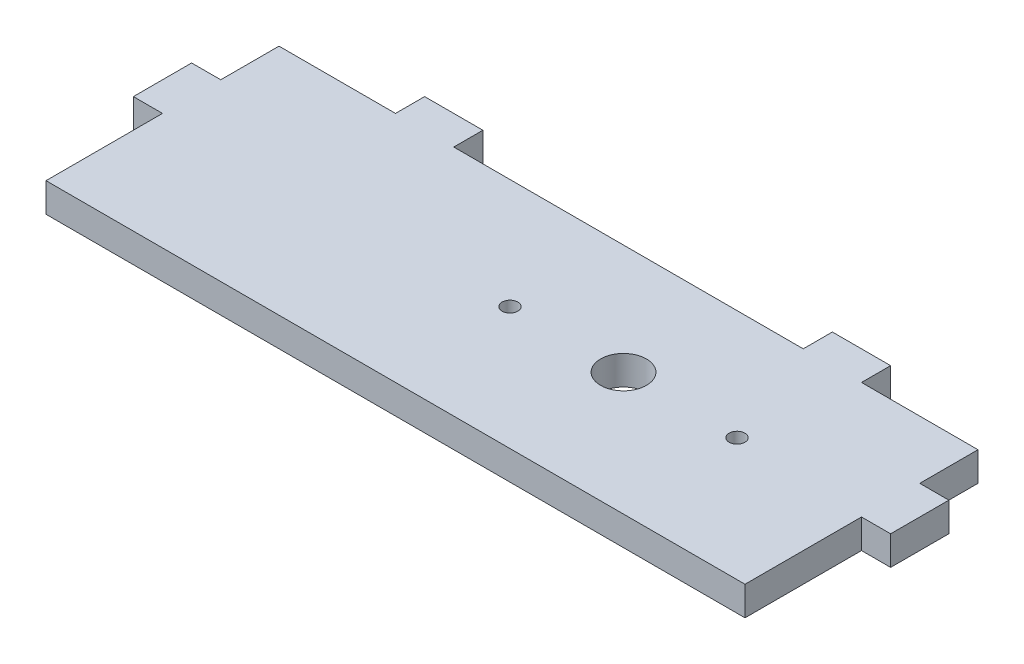
ISO-10303-21;
HEADER;
FILE_DESCRIPTION(('STEP AP214'),'2;1');
FILE_NAME('part.step','',(''),(''),'','','');
FILE_SCHEMA(('AUTOMOTIVE_DESIGN { 1 0 10303 214 1 1 1 1 }'));
ENDSEC;
DATA;
#1=APPLICATION_CONTEXT('core data for automotive mechanical design processes');
#2=APPLICATION_PROTOCOL_DEFINITION('international standard','automotive_design',2000,#1);
#3=PRODUCT_CONTEXT('',#1,'mechanical');
#4=PRODUCT('Part','Part','',(#3));
#5=PRODUCT_RELATED_PRODUCT_CATEGORY('part','',(#4));
#6=PRODUCT_DEFINITION_FORMATION('','',#4);
#7=PRODUCT_DEFINITION_CONTEXT('part definition',#1,'design');
#8=PRODUCT_DEFINITION('design','',#6,#7);
#9=PRODUCT_DEFINITION_SHAPE('','',#8);
#10=(LENGTH_UNIT() NAMED_UNIT(*) SI_UNIT(.MILLI.,.METRE.));
#11=(NAMED_UNIT(*) PLANE_ANGLE_UNIT() SI_UNIT($,.RADIAN.));
#12=(NAMED_UNIT(*) SI_UNIT($,.STERADIAN.) SOLID_ANGLE_UNIT());
#13=UNCERTAINTY_MEASURE_WITH_UNIT(LENGTH_MEASURE(1.E-05),#10,'distance_accuracy_value','');
#14=(GEOMETRIC_REPRESENTATION_CONTEXT(3) GLOBAL_UNCERTAINTY_ASSIGNED_CONTEXT((#13)) GLOBAL_UNIT_ASSIGNED_CONTEXT((#10,
#11,#12)) REPRESENTATION_CONTEXT('',''));
#15=CARTESIAN_POINT('',(0.,0.,0.));
#16=DIRECTION('',(0.,0.,1.));
#17=DIRECTION('',(1.,0.,0.));
#18=AXIS2_PLACEMENT_3D('',#15,#16,#17);
#19=CARTESIAN_POINT('',(0.,6.35,0.));
#20=DIRECTION('',(0.,0.,-1.));
#21=DIRECTION('',(-1.,0.,0.));
#22=AXIS2_PLACEMENT_3D('',#19,#20,#21);
#23=PLANE('',#22);
#24=DIRECTION('',(1.,0.,0.));
#25=VECTOR('',#24,1.);
#26=CARTESIAN_POINT('',(0.,0.,0.));
#27=LINE('',#26,#25);
#28=CARTESIAN_POINT('',(0.,0.,0.));
#29=VERTEX_POINT('',#28);
#30=CARTESIAN_POINT('',(152.4,0.,0.));
#31=VERTEX_POINT('',#30);
#32=EDGE_CURVE('E215',#29,#31,#27,.T.);
#33=ORIENTED_EDGE('',*,*,#32,.T.);
#34=DIRECTION('',(0.,-1.,0.));
#35=VECTOR('',#34,1.);
#36=CARTESIAN_POINT('',(152.4,6.35,0.));
#37=LINE('',#36,#35);
#38=CARTESIAN_POINT('',(152.4,6.35,0.));
#39=VERTEX_POINT('',#38);
#40=EDGE_CURVE('E11',#39,#31,#37,.T.);
#41=ORIENTED_EDGE('',*,*,#40,.F.);
#42=DIRECTION('',(1.,0.,0.));
#43=VECTOR('',#42,1.);
#44=CARTESIAN_POINT('',(0.,6.35,0.));
#45=LINE('',#44,#43);
#46=CARTESIAN_POINT('',(0.,6.35,0.));
#47=VERTEX_POINT('',#46);
#48=EDGE_CURVE('E654',#47,#39,#45,.T.);
#49=ORIENTED_EDGE('',*,*,#48,.F.);
#50=DIRECTION('',(0.,-1.,0.));
#51=VECTOR('',#50,1.);
#52=CARTESIAN_POINT('',(0.,6.35,0.));
#53=LINE('',#52,#51);
#54=EDGE_CURVE('E51',#47,#29,#53,.T.);
#55=ORIENTED_EDGE('',*,*,#54,.T.);
#56=EDGE_LOOP('',(#33,#41,#49,#55));
#57=FACE_BOUND('',#56,.T.);
#58=ADVANCED_FACE('F34',(#57),#23,.F.);
#59=CARTESIAN_POINT('',(152.4,6.35,0.));
#60=DIRECTION('',(-1.,0.,0.));
#61=DIRECTION('',(0.,0.,1.));
#62=AXIS2_PLACEMENT_3D('',#59,#60,#61);
#63=PLANE('',#62);
#64=DIRECTION('',(0.,0.,-1.));
#65=VECTOR('',#64,1.);
#66=CARTESIAN_POINT('',(152.4,0.,0.));
#67=LINE('',#66,#65);
#68=CARTESIAN_POINT('',(152.4,0.,-25.4));
#69=VERTEX_POINT('',#68);
#70=EDGE_CURVE('E217',#31,#69,#67,.T.);
#71=ORIENTED_EDGE('',*,*,#70,.T.);
#72=DIRECTION('',(0.,-1.,0.));
#73=VECTOR('',#72,1.);
#74=CARTESIAN_POINT('',(152.4,6.35,-25.4));
#75=LINE('',#74,#73);
#76=CARTESIAN_POINT('',(152.4,6.35,-25.4));
#77=VERTEX_POINT('',#76);
#78=EDGE_CURVE('E43',#77,#69,#75,.T.);
#79=ORIENTED_EDGE('',*,*,#78,.F.);
#80=DIRECTION('',(0.,0.,-1.));
#81=VECTOR('',#80,1.);
#82=CARTESIAN_POINT('',(152.4,6.35,0.));
#83=LINE('',#82,#81);
#84=EDGE_CURVE('E125',#39,#77,#83,.T.);
#85=ORIENTED_EDGE('',*,*,#84,.F.);
#86=ORIENTED_EDGE('',*,*,#40,.T.);
#87=EDGE_LOOP('',(#71,#79,#85,#86));
#88=FACE_BOUND('',#87,.T.);
#89=ADVANCED_FACE('F383',(#88),#63,.F.);
#90=CARTESIAN_POINT('',(0.,6.35,-25.4));
#91=DIRECTION('',(0.,0.,-1.));
#92=DIRECTION('',(-1.,0.,0.));
#93=AXIS2_PLACEMENT_3D('',#90,#91,#92);
#94=PLANE('',#93);
#95=DIRECTION('',(1.,0.,0.));
#96=VECTOR('',#95,1.);
#97=CARTESIAN_POINT('',(0.,0.,-25.4));
#98=LINE('',#97,#96);
#99=CARTESIAN_POINT('',(158.75,0.,-25.4));
#100=VERTEX_POINT('',#99);
#101=EDGE_CURVE('E219',#69,#100,#98,.T.);
#102=ORIENTED_EDGE('',*,*,#101,.T.);
#103=DIRECTION('',(0.,-1.,0.));
#104=VECTOR('',#103,1.);
#105=CARTESIAN_POINT('',(158.75,6.35,-25.4));
#106=LINE('',#105,#104);
#107=CARTESIAN_POINT('',(158.75,6.35,-25.4));
#108=VERTEX_POINT('',#107);
#109=EDGE_CURVE('E290',#108,#100,#106,.T.);
#110=ORIENTED_EDGE('',*,*,#109,.F.);
#111=DIRECTION('',(1.,0.,0.));
#112=VECTOR('',#111,1.);
#113=CARTESIAN_POINT('',(0.,6.35,-25.4));
#114=LINE('',#113,#112);
#115=EDGE_CURVE('E297',#77,#108,#114,.T.);
#116=ORIENTED_EDGE('',*,*,#115,.F.);
#117=ORIENTED_EDGE('',*,*,#78,.T.);
#118=EDGE_LOOP('',(#102,#110,#116,#117));
#119=FACE_BOUND('',#118,.T.);
#120=ADVANCED_FACE('F295',(#119),#94,.F.);
#121=CARTESIAN_POINT('',(158.75,6.35,0.));
#122=DIRECTION('',(1.,0.,0.));
#123=DIRECTION('',(0.,0.,-1.));
#124=AXIS2_PLACEMENT_3D('',#121,#122,#123);
#125=PLANE('',#124);
#126=DIRECTION('',(0.,0.,1.));
#127=VECTOR('',#126,1.);
#128=CARTESIAN_POINT('',(158.75,0.,0.));
#129=LINE('',#128,#127);
#130=CARTESIAN_POINT('',(158.75,0.,-38.1));
#131=VERTEX_POINT('',#130);
#132=EDGE_CURVE('E223',#131,#100,#129,.T.);
#133=ORIENTED_EDGE('',*,*,#132,.F.);
#134=DIRECTION('',(0.,-1.,0.));
#135=VECTOR('',#134,1.);
#136=CARTESIAN_POINT('',(158.75,6.35,-38.1));
#137=LINE('',#136,#135);
#138=CARTESIAN_POINT('',(158.75,6.35,-38.1));
#139=VERTEX_POINT('',#138);
#140=EDGE_CURVE('E288',#139,#131,#137,.T.);
#141=ORIENTED_EDGE('',*,*,#140,.F.);
#142=DIRECTION('',(0.,0.,1.));
#143=VECTOR('',#142,1.);
#144=CARTESIAN_POINT('',(158.75,6.35,0.));
#145=LINE('',#144,#143);
#146=EDGE_CURVE('E307',#139,#108,#145,.T.);
#147=ORIENTED_EDGE('',*,*,#146,.T.);
#148=ORIENTED_EDGE('',*,*,#109,.T.);
#149=EDGE_LOOP('',(#133,#141,#147,#148));
#150=FACE_BOUND('',#149,.T.);
#151=ADVANCED_FACE('F304',(#150),#125,.T.);
#152=CARTESIAN_POINT('',(0.,6.35,-38.1));
#153=DIRECTION('',(0.,0.,-1.));
#154=DIRECTION('',(-1.,0.,0.));
#155=AXIS2_PLACEMENT_3D('',#152,#153,#154);
#156=PLANE('',#155);
#157=DIRECTION('',(1.,0.,0.));
#158=VECTOR('',#157,1.);
#159=CARTESIAN_POINT('',(0.,0.,-38.1));
#160=LINE('',#159,#158);
#161=CARTESIAN_POINT('',(152.4,0.,-38.1));
#162=VERTEX_POINT('',#161);
#163=EDGE_CURVE('E226',#162,#131,#160,.T.);
#164=ORIENTED_EDGE('',*,*,#163,.F.);
#165=DIRECTION('',(0.,-1.,0.));
#166=VECTOR('',#165,1.);
#167=CARTESIAN_POINT('',(152.4,6.35,-38.1));
#168=LINE('',#167,#166);
#169=CARTESIAN_POINT('',(152.4,6.35,-38.1));
#170=VERTEX_POINT('',#169);
#171=EDGE_CURVE('E286',#170,#162,#168,.T.);
#172=ORIENTED_EDGE('',*,*,#171,.F.);
#173=DIRECTION('',(1.,0.,0.));
#174=VECTOR('',#173,1.);
#175=CARTESIAN_POINT('',(0.,6.35,-38.1));
#176=LINE('',#175,#174);
#177=EDGE_CURVE('E310',#170,#139,#176,.T.);
#178=ORIENTED_EDGE('',*,*,#177,.T.);
#179=ORIENTED_EDGE('',*,*,#140,.T.);
#180=EDGE_LOOP('',(#164,#172,#178,#179));
#181=FACE_BOUND('',#180,.T.);
#182=ADVANCED_FACE('F601',(#181),#156,.T.);
#183=CARTESIAN_POINT('',(152.4,0.,-50.8));
#184=VERTEX_POINT('',#183);
#185=EDGE_CURVE('E220',#162,#184,#67,.T.);
#186=ORIENTED_EDGE('',*,*,#185,.T.);
#187=DIRECTION('',(0.,-1.,0.));
#188=VECTOR('',#187,1.);
#189=CARTESIAN_POINT('',(152.4,6.35,-50.8));
#190=LINE('',#189,#188);
#191=CARTESIAN_POINT('',(152.4,6.35,-50.8));
#192=VERTEX_POINT('',#191);
#193=EDGE_CURVE('E284',#192,#184,#190,.T.);
#194=ORIENTED_EDGE('',*,*,#193,.F.);
#195=EDGE_CURVE('E312',#170,#192,#83,.T.);
#196=ORIENTED_EDGE('',*,*,#195,.F.);
#197=ORIENTED_EDGE('',*,*,#171,.T.);
#198=EDGE_LOOP('',(#186,#194,#196,#197));
#199=FACE_BOUND('',#198,.T.);
#200=ADVANCED_FACE('F389',(#199),#63,.F.);
#201=CARTESIAN_POINT('',(0.,6.35,-50.8));
#202=DIRECTION('',(0.,0.,-1.));
#203=DIRECTION('',(-1.,0.,0.));
#204=AXIS2_PLACEMENT_3D('',#201,#202,#203);
#205=PLANE('',#204);
#206=DIRECTION('',(1.,0.,0.));
#207=VECTOR('',#206,1.);
#208=CARTESIAN_POINT('',(0.,0.,-50.8));
#209=LINE('',#208,#207);
#210=CARTESIAN_POINT('',(127.,0.,-50.8));
#211=VERTEX_POINT('',#210);
#212=EDGE_CURVE('E229',#211,#184,#209,.T.);
#213=ORIENTED_EDGE('',*,*,#212,.F.);
#214=DIRECTION('',(0.,-1.,0.));
#215=VECTOR('',#214,1.);
#216=CARTESIAN_POINT('',(127.,6.35,-50.8));
#217=LINE('',#216,#215);
#218=CARTESIAN_POINT('',(127.,6.35,-50.8));
#219=VERTEX_POINT('',#218);
#220=EDGE_CURVE('E282',#219,#211,#217,.T.);
#221=ORIENTED_EDGE('',*,*,#220,.F.);
#222=DIRECTION('',(1.,0.,0.));
#223=VECTOR('',#222,1.);
#224=CARTESIAN_POINT('',(0.,6.35,-50.8));
#225=LINE('',#224,#223);
#226=EDGE_CURVE('E317',#219,#192,#225,.T.);
#227=ORIENTED_EDGE('',*,*,#226,.T.);
#228=ORIENTED_EDGE('',*,*,#193,.T.);
#229=EDGE_LOOP('',(#213,#221,#227,#228));
#230=FACE_BOUND('',#229,.T.);
#231=ADVANCED_FACE('F380',(#230),#205,.T.);
#232=CARTESIAN_POINT('',(127.,6.35,0.));
#233=DIRECTION('',(-1.,0.,0.));
#234=DIRECTION('',(0.,0.,1.));
#235=AXIS2_PLACEMENT_3D('',#232,#233,#234);
#236=PLANE('',#235);
#237=DIRECTION('',(0.,0.,-1.));
#238=VECTOR('',#237,1.);
#239=CARTESIAN_POINT('',(127.,0.,0.));
#240=LINE('',#239,#238);
#241=CARTESIAN_POINT('',(127.,0.,-57.15));
#242=VERTEX_POINT('',#241);
#243=EDGE_CURVE('E232',#211,#242,#240,.T.);
#244=ORIENTED_EDGE('',*,*,#243,.T.);
#245=DIRECTION('',(0.,-1.,0.));
#246=VECTOR('',#245,1.);
#247=CARTESIAN_POINT('',(127.,6.35,-57.15));
#248=LINE('',#247,#246);
#249=CARTESIAN_POINT('',(127.,6.35,-57.15));
#250=VERTEX_POINT('',#249);
#251=EDGE_CURVE('E280',#250,#242,#248,.T.);
#252=ORIENTED_EDGE('',*,*,#251,.F.);
#253=DIRECTION('',(0.,0.,-1.));
#254=VECTOR('',#253,1.);
#255=CARTESIAN_POINT('',(127.,6.35,0.));
#256=LINE('',#255,#254);
#257=EDGE_CURVE('E320',#219,#250,#256,.T.);
#258=ORIENTED_EDGE('',*,*,#257,.F.);
#259=ORIENTED_EDGE('',*,*,#220,.T.);
#260=EDGE_LOOP('',(#244,#252,#258,#259));
#261=FACE_BOUND('',#260,.T.);
#262=ADVANCED_FACE('F573',(#261),#236,.F.);
#263=CARTESIAN_POINT('',(0.,6.35,-57.1499999999999));
#264=DIRECTION('',(0.,0.,-1.));
#265=DIRECTION('',(-1.,0.,0.));
#266=AXIS2_PLACEMENT_3D('',#263,#264,#265);
#267=PLANE('',#266);
#268=DIRECTION('',(1.,0.,0.));
#269=VECTOR('',#268,1.);
#270=CARTESIAN_POINT('',(0.,0.,-57.1499999999999));
#271=LINE('',#270,#269);
#272=CARTESIAN_POINT('',(114.3,0.,-57.15));
#273=VERTEX_POINT('',#272);
#274=EDGE_CURVE('E237',#273,#242,#271,.T.);
#275=ORIENTED_EDGE('',*,*,#274,.F.);
#276=DIRECTION('',(0.,-1.,0.));
#277=VECTOR('',#276,1.);
#278=CARTESIAN_POINT('',(114.3,6.35,-57.15));
#279=LINE('',#278,#277);
#280=CARTESIAN_POINT('',(114.3,6.35,-57.15));
#281=VERTEX_POINT('',#280);
#282=EDGE_CURVE('E278',#281,#273,#279,.T.);
#283=ORIENTED_EDGE('',*,*,#282,.F.);
#284=DIRECTION('',(1.,0.,0.));
#285=VECTOR('',#284,1.);
#286=CARTESIAN_POINT('',(0.,6.35,-57.1499999999999));
#287=LINE('',#286,#285);
#288=EDGE_CURVE('E324',#281,#250,#287,.T.);
#289=ORIENTED_EDGE('',*,*,#288,.T.);
#290=ORIENTED_EDGE('',*,*,#251,.T.);
#291=EDGE_LOOP('',(#275,#283,#289,#290));
#292=FACE_BOUND('',#291,.T.);
#293=ADVANCED_FACE('F565',(#292),#267,.T.);
#294=CARTESIAN_POINT('',(114.3,6.35,2.4980018054066E-13));
#295=DIRECTION('',(-1.,0.,0.));
#296=DIRECTION('',(0.,0.,1.));
#297=AXIS2_PLACEMENT_3D('',#294,#295,#296);
#298=PLANE('',#297);
#299=DIRECTION('',(0.,0.,-1.));
#300=VECTOR('',#299,1.);
#301=CARTESIAN_POINT('',(114.3,0.,2.4980018054066E-13));
#302=LINE('',#301,#300);
#303=CARTESIAN_POINT('',(114.3,0.,-50.8));
#304=VERTEX_POINT('',#303);
#305=EDGE_CURVE('E240',#304,#273,#302,.T.);
#306=ORIENTED_EDGE('',*,*,#305,.F.);
#307=DIRECTION('',(0.,-1.,0.));
#308=VECTOR('',#307,1.);
#309=CARTESIAN_POINT('',(114.3,6.35,-50.8));
#310=LINE('',#309,#308);
#311=CARTESIAN_POINT('',(114.3,6.35,-50.8));
#312=VERTEX_POINT('',#311);
#313=EDGE_CURVE('E276',#312,#304,#310,.T.);
#314=ORIENTED_EDGE('',*,*,#313,.F.);
#315=DIRECTION('',(0.,0.,-1.));
#316=VECTOR('',#315,1.);
#317=CARTESIAN_POINT('',(114.3,6.35,2.4980018054066E-13));
#318=LINE('',#317,#316);
#319=EDGE_CURVE('E327',#312,#281,#318,.T.);
#320=ORIENTED_EDGE('',*,*,#319,.T.);
#321=ORIENTED_EDGE('',*,*,#282,.T.);
#322=EDGE_LOOP('',(#306,#314,#320,#321));
#323=FACE_BOUND('',#322,.T.);
#324=ADVANCED_FACE('F354',(#323),#298,.T.);
#325=CARTESIAN_POINT('',(38.1,0.,-50.8));
#326=VERTEX_POINT('',#325);
#327=EDGE_CURVE('E234',#326,#304,#209,.T.);
#328=ORIENTED_EDGE('',*,*,#327,.F.);
#329=DIRECTION('',(0.,-1.,0.));
#330=VECTOR('',#329,1.);
#331=CARTESIAN_POINT('',(38.1,6.35,-50.8));
#332=LINE('',#331,#330);
#333=CARTESIAN_POINT('',(38.1,6.35,-50.8));
#334=VERTEX_POINT('',#333);
#335=EDGE_CURVE('E274',#334,#326,#332,.T.);
#336=ORIENTED_EDGE('',*,*,#335,.F.);
#337=EDGE_CURVE('E322',#334,#312,#225,.T.);
#338=ORIENTED_EDGE('',*,*,#337,.T.);
#339=ORIENTED_EDGE('',*,*,#313,.T.);
#340=EDGE_LOOP('',(#328,#336,#338,#339));
#341=FACE_BOUND('',#340,.T.);
#342=ADVANCED_FACE('F346',(#341),#205,.T.);
#343=CARTESIAN_POINT('',(38.1,6.35,0.));
#344=DIRECTION('',(-1.,0.,0.));
#345=DIRECTION('',(0.,0.,1.));
#346=AXIS2_PLACEMENT_3D('',#343,#344,#345);
#347=PLANE('',#346);
#348=DIRECTION('',(0.,0.,-1.));
#349=VECTOR('',#348,1.);
#350=CARTESIAN_POINT('',(38.1,0.,0.));
#351=LINE('',#350,#349);
#352=CARTESIAN_POINT('',(38.1,0.,-57.15));
#353=VERTEX_POINT('',#352);
#354=EDGE_CURVE('E243',#326,#353,#351,.T.);
#355=ORIENTED_EDGE('',*,*,#354,.T.);
#356=DIRECTION('',(0.,-1.,0.));
#357=VECTOR('',#356,1.);
#358=CARTESIAN_POINT('',(38.1,6.35,-57.15));
#359=LINE('',#358,#357);
#360=CARTESIAN_POINT('',(38.1,6.35,-57.15));
#361=VERTEX_POINT('',#360);
#362=EDGE_CURVE('E272',#361,#353,#359,.T.);
#363=ORIENTED_EDGE('',*,*,#362,.F.);
#364=DIRECTION('',(0.,0.,-1.));
#365=VECTOR('',#364,1.);
#366=CARTESIAN_POINT('',(38.1,6.35,0.));
#367=LINE('',#366,#365);
#368=EDGE_CURVE('E330',#334,#361,#367,.T.);
#369=ORIENTED_EDGE('',*,*,#368,.F.);
#370=ORIENTED_EDGE('',*,*,#335,.T.);
#371=EDGE_LOOP('',(#355,#363,#369,#370));
#372=FACE_BOUND('',#371,.T.);
#373=ADVANCED_FACE('F371',(#372),#347,.F.);
#374=CARTESIAN_POINT('',(0.,6.35,-57.15));
#375=DIRECTION('',(0.,0.,-1.));
#376=DIRECTION('',(-1.,0.,0.));
#377=AXIS2_PLACEMENT_3D('',#374,#375,#376);
#378=PLANE('',#377);
#379=DIRECTION('',(1.,0.,0.));
#380=VECTOR('',#379,1.);
#381=CARTESIAN_POINT('',(0.,0.,-57.15));
#382=LINE('',#381,#380);
#383=CARTESIAN_POINT('',(25.4,0.,-57.15));
#384=VERTEX_POINT('',#383);
#385=EDGE_CURVE('E246',#384,#353,#382,.T.);
#386=ORIENTED_EDGE('',*,*,#385,.F.);
#387=DIRECTION('',(0.,-1.,0.));
#388=VECTOR('',#387,1.);
#389=CARTESIAN_POINT('',(25.4,6.35,-57.15));
#390=LINE('',#389,#388);
#391=CARTESIAN_POINT('',(25.4,6.35,-57.15));
#392=VERTEX_POINT('',#391);
#393=EDGE_CURVE('E270',#392,#384,#390,.T.);
#394=ORIENTED_EDGE('',*,*,#393,.F.);
#395=DIRECTION('',(1.,0.,0.));
#396=VECTOR('',#395,1.);
#397=CARTESIAN_POINT('',(0.,6.35,-57.15));
#398=LINE('',#397,#396);
#399=EDGE_CURVE('E332',#392,#361,#398,.T.);
#400=ORIENTED_EDGE('',*,*,#399,.T.);
#401=ORIENTED_EDGE('',*,*,#362,.T.);
#402=EDGE_LOOP('',(#386,#394,#400,#401));
#403=FACE_BOUND('',#402,.T.);
#404=ADVANCED_FACE('F369',(#403),#378,.T.);
#405=CARTESIAN_POINT('',(25.4,6.35,0.));
#406=DIRECTION('',(-1.,0.,0.));
#407=DIRECTION('',(0.,0.,1.));
#408=AXIS2_PLACEMENT_3D('',#405,#406,#407);
#409=PLANE('',#408);
#410=DIRECTION('',(0.,0.,-1.));
#411=VECTOR('',#410,1.);
#412=CARTESIAN_POINT('',(25.4,0.,0.));
#413=LINE('',#412,#411);
#414=CARTESIAN_POINT('',(25.4,0.,-50.8));
#415=VERTEX_POINT('',#414);
#416=EDGE_CURVE('E249',#415,#384,#413,.T.);
#417=ORIENTED_EDGE('',*,*,#416,.F.);
#418=DIRECTION('',(0.,-1.,0.));
#419=VECTOR('',#418,1.);
#420=CARTESIAN_POINT('',(25.4,6.35,-50.8));
#421=LINE('',#420,#419);
#422=CARTESIAN_POINT('',(25.4,6.35,-50.8));
#423=VERTEX_POINT('',#422);
#424=EDGE_CURVE('E268',#423,#415,#421,.T.);
#425=ORIENTED_EDGE('',*,*,#424,.F.);
#426=DIRECTION('',(0.,0.,-1.));
#427=VECTOR('',#426,1.);
#428=CARTESIAN_POINT('',(25.4,6.35,0.));
#429=LINE('',#428,#427);
#430=EDGE_CURVE('E335',#423,#392,#429,.T.);
#431=ORIENTED_EDGE('',*,*,#430,.T.);
#432=ORIENTED_EDGE('',*,*,#393,.T.);
#433=EDGE_LOOP('',(#417,#425,#431,#432));
#434=FACE_BOUND('',#433,.T.);
#435=ADVANCED_FACE('F366',(#434),#409,.T.);
#436=CARTESIAN_POINT('',(0.,0.,-50.8));
#437=VERTEX_POINT('',#436);
#438=EDGE_CURVE('E233',#437,#415,#209,.T.);
#439=ORIENTED_EDGE('',*,*,#438,.F.);
#440=DIRECTION('',(0.,-1.,0.));
#441=VECTOR('',#440,1.);
#442=CARTESIAN_POINT('',(0.,6.35,-50.8));
#443=LINE('',#442,#441);
#444=CARTESIAN_POINT('',(0.,6.35,-50.8));
#445=VERTEX_POINT('',#444);
#446=EDGE_CURVE('E266',#445,#437,#443,.T.);
#447=ORIENTED_EDGE('',*,*,#446,.F.);
#448=EDGE_CURVE('E321',#445,#423,#225,.T.);
#449=ORIENTED_EDGE('',*,*,#448,.T.);
#450=ORIENTED_EDGE('',*,*,#424,.T.);
#451=EDGE_LOOP('',(#439,#447,#449,#450));
#452=FACE_BOUND('',#451,.T.);
#453=ADVANCED_FACE('F363',(#452),#205,.T.);
#454=CARTESIAN_POINT('',(0.,6.35,0.));
#455=DIRECTION('',(-1.,0.,0.));
#456=DIRECTION('',(0.,0.,1.));
#457=AXIS2_PLACEMENT_3D('',#454,#455,#456);
#458=PLANE('',#457);
#459=DIRECTION('',(0.,0.,-1.));
#460=VECTOR('',#459,1.);
#461=CARTESIAN_POINT('',(0.,0.,0.));
#462=LINE('',#461,#460);
#463=CARTESIAN_POINT('',(0.,0.,-38.1));
#464=VERTEX_POINT('',#463);
#465=EDGE_CURVE('E252',#464,#437,#462,.T.);
#466=ORIENTED_EDGE('',*,*,#465,.F.);
#467=DIRECTION('',(0.,-1.,0.));
#468=VECTOR('',#467,1.);
#469=CARTESIAN_POINT('',(0.,6.35,-38.1));
#470=LINE('',#469,#468);
#471=CARTESIAN_POINT('',(0.,6.35,-38.1));
#472=VERTEX_POINT('',#471);
#473=EDGE_CURVE('E264',#472,#464,#470,.T.);
#474=ORIENTED_EDGE('',*,*,#473,.F.);
#475=DIRECTION('',(0.,0.,-1.));
#476=VECTOR('',#475,1.);
#477=CARTESIAN_POINT('',(0.,6.35,0.));
#478=LINE('',#477,#476);
#479=EDGE_CURVE('E203',#472,#445,#478,.T.);
#480=ORIENTED_EDGE('',*,*,#479,.T.);
#481=ORIENTED_EDGE('',*,*,#446,.T.);
#482=EDGE_LOOP('',(#466,#474,#480,#481));
#483=FACE_BOUND('',#482,.T.);
#484=ADVANCED_FACE('F424',(#483),#458,.T.);
#485=CARTESIAN_POINT('',(-1.2490009027033E-13,6.35,-38.1));
#486=DIRECTION('',(0.,0.,1.));
#487=DIRECTION('',(1.,0.,0.));
#488=AXIS2_PLACEMENT_3D('',#485,#486,#487);
#489=PLANE('',#488);
#490=DIRECTION('',(-1.,0.,0.));
#491=VECTOR('',#490,1.);
#492=CARTESIAN_POINT('',(-1.2490009027033E-13,0.,-38.1));
#493=LINE('',#492,#491);
#494=CARTESIAN_POINT('',(-6.35,0.,-38.1));
#495=VERTEX_POINT('',#494);
#496=EDGE_CURVE('E255',#464,#495,#493,.T.);
#497=ORIENTED_EDGE('',*,*,#496,.T.);
#498=DIRECTION('',(0.,-1.,0.));
#499=VECTOR('',#498,1.);
#500=CARTESIAN_POINT('',(-6.35,6.35,-38.1));
#501=LINE('',#500,#499);
#502=CARTESIAN_POINT('',(-6.35,6.35,-38.1));
#503=VERTEX_POINT('',#502);
#504=EDGE_CURVE('E197',#503,#495,#501,.T.);
#505=ORIENTED_EDGE('',*,*,#504,.F.);
#506=DIRECTION('',(-1.,0.,0.));
#507=VECTOR('',#506,1.);
#508=CARTESIAN_POINT('',(-1.2490009027033E-13,6.35,-38.1));
#509=LINE('',#508,#507);
#510=EDGE_CURVE('E185',#472,#503,#509,.T.);
#511=ORIENTED_EDGE('',*,*,#510,.F.);
#512=ORIENTED_EDGE('',*,*,#473,.T.);
#513=EDGE_LOOP('',(#497,#505,#511,#512));
#514=FACE_BOUND('',#513,.T.);
#515=ADVANCED_FACE('F429',(#514),#489,.F.);
#516=CARTESIAN_POINT('',(-6.34999999999999,6.35,0.));
#517=DIRECTION('',(1.,0.,0.));
#518=DIRECTION('',(0.,0.,-1.));
#519=AXIS2_PLACEMENT_3D('',#516,#517,#518);
#520=PLANE('',#519);
#521=DIRECTION('',(0.,0.,1.));
#522=VECTOR('',#521,1.);
#523=CARTESIAN_POINT('',(-6.34999999999999,0.,0.));
#524=LINE('',#523,#522);
#525=CARTESIAN_POINT('',(-6.35,0.,-25.4));
#526=VERTEX_POINT('',#525);
#527=EDGE_CURVE('E194',#495,#526,#524,.T.);
#528=ORIENTED_EDGE('',*,*,#527,.T.);
#529=DIRECTION('',(0.,-1.,0.));
#530=VECTOR('',#529,1.);
#531=CARTESIAN_POINT('',(-6.35,6.35,-25.4));
#532=LINE('',#531,#530);
#533=CARTESIAN_POINT('',(-6.35,6.35,-25.4));
#534=VERTEX_POINT('',#533);
#535=EDGE_CURVE('E191',#534,#526,#532,.T.);
#536=ORIENTED_EDGE('',*,*,#535,.F.);
#537=DIRECTION('',(0.,0.,1.));
#538=VECTOR('',#537,1.);
#539=CARTESIAN_POINT('',(-6.34999999999999,6.35,0.));
#540=LINE('',#539,#538);
#541=EDGE_CURVE('E177',#503,#534,#540,.T.);
#542=ORIENTED_EDGE('',*,*,#541,.F.);
#543=ORIENTED_EDGE('',*,*,#504,.T.);
#544=EDGE_LOOP('',(#528,#536,#542,#543));
#545=FACE_BOUND('',#544,.T.);
#546=ADVANCED_FACE('F192',(#545),#520,.F.);
#547=CARTESIAN_POINT('',(0.,6.35,-25.4));
#548=DIRECTION('',(0.,0.,1.));
#549=DIRECTION('',(1.,0.,0.));
#550=AXIS2_PLACEMENT_3D('',#547,#548,#549);
#551=PLANE('',#550);
#552=DIRECTION('',(-1.,0.,0.));
#553=VECTOR('',#552,1.);
#554=CARTESIAN_POINT('',(0.,0.,-25.4));
#555=LINE('',#554,#553);
#556=CARTESIAN_POINT('',(0.,0.,-25.4));
#557=VERTEX_POINT('',#556);
#558=EDGE_CURVE('E259',#557,#526,#555,.T.);
#559=ORIENTED_EDGE('',*,*,#558,.F.);
#560=DIRECTION('',(0.,-1.,0.));
#561=VECTOR('',#560,1.);
#562=CARTESIAN_POINT('',(0.,6.35,-25.4));
#563=LINE('',#562,#561);
#564=CARTESIAN_POINT('',(0.,6.35,-25.4));
#565=VERTEX_POINT('',#564);
#566=EDGE_CURVE('E113',#565,#557,#563,.T.);
#567=ORIENTED_EDGE('',*,*,#566,.F.);
#568=DIRECTION('',(-1.,0.,0.));
#569=VECTOR('',#568,1.);
#570=CARTESIAN_POINT('',(0.,6.35,-25.4));
#571=LINE('',#570,#569);
#572=EDGE_CURVE('E182',#565,#534,#571,.T.);
#573=ORIENTED_EDGE('',*,*,#572,.T.);
#574=ORIENTED_EDGE('',*,*,#535,.T.);
#575=EDGE_LOOP('',(#559,#567,#573,#574));
#576=FACE_BOUND('',#575,.T.);
#577=ADVANCED_FACE('F199',(#576),#551,.T.);
#578=CARTESIAN_POINT('',(99.1099999,6.35,-26.799999994));
#579=DIRECTION('',(0.,-1.,0.));
#580=DIRECTION('',(0.,0.,-1.));
#581=AXIS2_PLACEMENT_3D('',#578,#579,#580);
#582=CYLINDRICAL_SURFACE('',#581,5.000000033);
#583=CARTESIAN_POINT('',(99.1099999,6.35,-26.799999994));
#584=DIRECTION('',(0.,1.,0.));
#585=DIRECTION('',(0.,0.,1.));
#586=AXIS2_PLACEMENT_3D('',#583,#584,#585);
#587=CIRCLE('',#586,5.000000033);
#588=CARTESIAN_POINT('',(99.1099999,6.35,-21.799999961));
#589=VERTEX_POINT('',#588);
#590=EDGE_CURVE('E655',#589,#589,#587,.T.);
#591=ORIENTED_EDGE('',*,*,#590,.T.);
#592=EDGE_LOOP('',(#591));
#593=FACE_BOUND('',#592,.T.);
#594=CARTESIAN_POINT('',(99.1099999,0.,-26.799999994));
#595=DIRECTION('',(0.,1.,0.));
#596=DIRECTION('',(0.,0.,1.));
#597=AXIS2_PLACEMENT_3D('',#594,#595,#596);
#598=CIRCLE('',#597,5.000000033);
#599=CARTESIAN_POINT('',(99.1099999,0.,-21.799999961));
#600=VERTEX_POINT('',#599);
#601=EDGE_CURVE('E212',#600,#600,#598,.T.);
#602=ORIENTED_EDGE('',*,*,#601,.F.);
#603=EDGE_LOOP('',(#602));
#604=FACE_BOUND('',#603,.T.);
#605=ADVANCED_FACE('F393',(#593,#604),#582,.F.);
#606=CARTESIAN_POINT('',(123.85999993,6.35,-26.799999994));
#607=DIRECTION('',(0.,-1.,0.));
#608=DIRECTION('',(0.,0.,-1.));
#609=AXIS2_PLACEMENT_3D('',#606,#607,#608);
#610=CYLINDRICAL_SURFACE('',#609,1.72499997899996);
#611=CARTESIAN_POINT('',(123.85999993,6.35,-26.799999994));
#612=DIRECTION('',(0.,1.,0.));
#613=DIRECTION('',(0.,0.,1.));
#614=AXIS2_PLACEMENT_3D('',#611,#612,#613);
#615=CIRCLE('',#614,1.72499997899996);
#616=CARTESIAN_POINT('',(123.85999993,6.35,-25.075000015));
#617=VERTEX_POINT('',#616);
#618=EDGE_CURVE('E407',#617,#617,#615,.T.);
#619=ORIENTED_EDGE('',*,*,#618,.T.);
#620=EDGE_LOOP('',(#619));
#621=FACE_BOUND('',#620,.T.);
#622=CARTESIAN_POINT('',(123.85999993,0.,-26.799999994));
#623=DIRECTION('',(0.,1.,0.));
#624=DIRECTION('',(0.,0.,1.));
#625=AXIS2_PLACEMENT_3D('',#622,#623,#624);
#626=CIRCLE('',#625,1.72499997899996);
#627=CARTESIAN_POINT('',(123.85999993,0.,-25.075000015));
#628=VERTEX_POINT('',#627);
#629=EDGE_CURVE('E209',#628,#628,#626,.T.);
#630=ORIENTED_EDGE('',*,*,#629,.F.);
#631=EDGE_LOOP('',(#630));
#632=FACE_BOUND('',#631,.T.);
#633=ADVANCED_FACE('F395',(#621,#632),#610,.F.);
#634=CARTESIAN_POINT('',(74.35999987,6.35,-26.799999994));
#635=DIRECTION('',(0.,-1.,0.));
#636=DIRECTION('',(0.,0.,-1.));
#637=AXIS2_PLACEMENT_3D('',#634,#635,#636);
#638=CYLINDRICAL_SURFACE('',#637,1.724999979);
#639=CARTESIAN_POINT('',(74.35999987,6.35,-26.799999994));
#640=DIRECTION('',(0.,1.,0.));
#641=DIRECTION('',(0.,0.,1.));
#642=AXIS2_PLACEMENT_3D('',#639,#640,#641);
#643=CIRCLE('',#642,1.724999979);
#644=CARTESIAN_POINT('',(74.35999987,6.35,-25.075000015));
#645=VERTEX_POINT('',#644);
#646=EDGE_CURVE('E661',#645,#645,#643,.T.);
#647=ORIENTED_EDGE('',*,*,#646,.T.);
#648=EDGE_LOOP('',(#647));
#649=FACE_BOUND('',#648,.T.);
#650=CARTESIAN_POINT('',(74.35999987,0.,-26.799999994));
#651=DIRECTION('',(0.,1.,0.));
#652=DIRECTION('',(0.,0.,1.));
#653=AXIS2_PLACEMENT_3D('',#650,#651,#652);
#654=CIRCLE('',#653,1.724999979);
#655=CARTESIAN_POINT('',(74.35999987,0.,-25.075000015));
#656=VERTEX_POINT('',#655);
#657=EDGE_CURVE('E206',#656,#656,#654,.T.);
#658=ORIENTED_EDGE('',*,*,#657,.F.);
#659=EDGE_LOOP('',(#658));
#660=FACE_BOUND('',#659,.T.);
#661=ADVANCED_FACE('F36',(#649,#660),#638,.F.);
#662=EDGE_CURVE('E256',#29,#557,#462,.T.);
#663=ORIENTED_EDGE('',*,*,#662,.F.);
#664=ORIENTED_EDGE('',*,*,#54,.F.);
#665=EDGE_CURVE('E200',#47,#565,#478,.T.);
#666=ORIENTED_EDGE('',*,*,#665,.T.);
#667=ORIENTED_EDGE('',*,*,#566,.T.);
#668=EDGE_LOOP('',(#663,#664,#666,#667));
#669=FACE_BOUND('',#668,.T.);
#670=ADVANCED_FACE('F402',(#669),#458,.T.);
#671=CARTESIAN_POINT('',(0.,6.35,0.));
#672=DIRECTION('',(0.,1.,0.));
#673=DIRECTION('',(0.,0.,1.));
#674=AXIS2_PLACEMENT_3D('',#671,#672,#673);
#675=PLANE('',#674);
#676=ORIENTED_EDGE('',*,*,#646,.F.);
#677=EDGE_LOOP('',(#676));
#678=FACE_BOUND('',#677,.T.);
#679=ORIENTED_EDGE('',*,*,#618,.F.);
#680=EDGE_LOOP('',(#679));
#681=FACE_BOUND('',#680,.T.);
#682=ORIENTED_EDGE('',*,*,#590,.F.);
#683=EDGE_LOOP('',(#682));
#684=FACE_BOUND('',#683,.T.);
#685=ORIENTED_EDGE('',*,*,#48,.T.);
#686=ORIENTED_EDGE('',*,*,#84,.T.);
#687=ORIENTED_EDGE('',*,*,#115,.T.);
#688=ORIENTED_EDGE('',*,*,#146,.F.);
#689=ORIENTED_EDGE('',*,*,#177,.F.);
#690=ORIENTED_EDGE('',*,*,#195,.T.);
#691=ORIENTED_EDGE('',*,*,#226,.F.);
#692=ORIENTED_EDGE('',*,*,#257,.T.);
#693=ORIENTED_EDGE('',*,*,#288,.F.);
#694=ORIENTED_EDGE('',*,*,#319,.F.);
#695=ORIENTED_EDGE('',*,*,#337,.F.);
#696=ORIENTED_EDGE('',*,*,#368,.T.);
#697=ORIENTED_EDGE('',*,*,#399,.F.);
#698=ORIENTED_EDGE('',*,*,#430,.F.);
#699=ORIENTED_EDGE('',*,*,#448,.F.);
#700=ORIENTED_EDGE('',*,*,#479,.F.);
#701=ORIENTED_EDGE('',*,*,#510,.T.);
#702=ORIENTED_EDGE('',*,*,#541,.T.);
#703=ORIENTED_EDGE('',*,*,#572,.F.);
#704=ORIENTED_EDGE('',*,*,#665,.F.);
#705=EDGE_LOOP('',(#685,#686,#687,#688,#689,#690,#691,#692,#693,#694,#695,#696,#697,#698,#699,
#700,#701,#702,#703,#704));
#706=FACE_BOUND('',#705,.T.);
#707=ADVANCED_FACE('F179',(#678,#681,#684,#706),#675,.T.);
#708=CARTESIAN_POINT('',(0.,0.,0.));
#709=DIRECTION('',(0.,1.,0.));
#710=DIRECTION('',(0.,0.,1.));
#711=AXIS2_PLACEMENT_3D('',#708,#709,#710);
#712=PLANE('',#711);
#713=ORIENTED_EDGE('',*,*,#657,.T.);
#714=EDGE_LOOP('',(#713));
#715=FACE_BOUND('',#714,.T.);
#716=ORIENTED_EDGE('',*,*,#629,.T.);
#717=EDGE_LOOP('',(#716));
#718=FACE_BOUND('',#717,.T.);
#719=ORIENTED_EDGE('',*,*,#601,.T.);
#720=EDGE_LOOP('',(#719));
#721=FACE_BOUND('',#720,.T.);
#722=ORIENTED_EDGE('',*,*,#32,.F.);
#723=ORIENTED_EDGE('',*,*,#662,.T.);
#724=ORIENTED_EDGE('',*,*,#558,.T.);
#725=ORIENTED_EDGE('',*,*,#527,.F.);
#726=ORIENTED_EDGE('',*,*,#496,.F.);
#727=ORIENTED_EDGE('',*,*,#465,.T.);
#728=ORIENTED_EDGE('',*,*,#438,.T.);
#729=ORIENTED_EDGE('',*,*,#416,.T.);
#730=ORIENTED_EDGE('',*,*,#385,.T.);
#731=ORIENTED_EDGE('',*,*,#354,.F.);
#732=ORIENTED_EDGE('',*,*,#327,.T.);
#733=ORIENTED_EDGE('',*,*,#305,.T.);
#734=ORIENTED_EDGE('',*,*,#274,.T.);
#735=ORIENTED_EDGE('',*,*,#243,.F.);
#736=ORIENTED_EDGE('',*,*,#212,.T.);
#737=ORIENTED_EDGE('',*,*,#185,.F.);
#738=ORIENTED_EDGE('',*,*,#163,.T.);
#739=ORIENTED_EDGE('',*,*,#132,.T.);
#740=ORIENTED_EDGE('',*,*,#101,.F.);
#741=ORIENTED_EDGE('',*,*,#70,.F.);
#742=EDGE_LOOP('',(#722,#723,#724,#725,#726,#727,#728,#729,#730,#731,#732,#733,#734,#735,#736,
#737,#738,#739,#740,#741));
#743=FACE_BOUND('',#742,.T.);
#744=ADVANCED_FACE('F299',(#715,#718,#721,#743),#712,.F.);
#745=CLOSED_SHELL('',(#58,#89,#120,#151,#182,#200,#231,#262,#293,#324,#342,#373,#404,#435,#453,
#484,#515,#546,#577,#605,#633,#661,#670,#707,#744));
#746=MANIFOLD_SOLID_BREP('B2',#745);
#747=ADVANCED_BREP_SHAPE_REPRESENTATION('',(#18,#746),#14);
#748=SHAPE_DEFINITION_REPRESENTATION(#9,#747);
ENDSEC;
END-ISO-10303-21;
